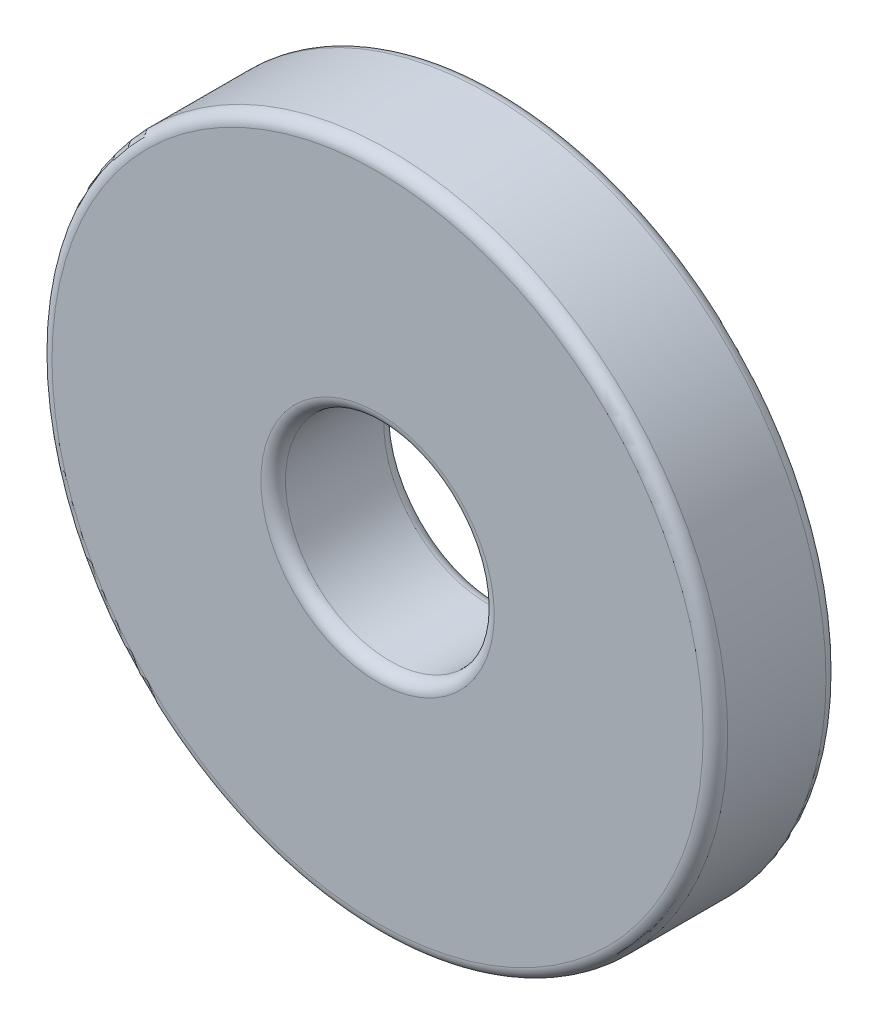
ISO-10303-21;
HEADER;
FILE_DESCRIPTION(('STEP AP214'),'2;1');
FILE_NAME('part.step','',(''),(''),'','','');
FILE_SCHEMA(('AUTOMOTIVE_DESIGN { 1 0 10303 214 1 1 1 1 }'));
ENDSEC;
DATA;
#1=APPLICATION_CONTEXT('core data for automotive mechanical design processes');
#2=APPLICATION_PROTOCOL_DEFINITION('international standard','automotive_design',2000,#1);
#3=PRODUCT_CONTEXT('',#1,'mechanical');
#4=PRODUCT('Part','Part','',(#3));
#5=PRODUCT_RELATED_PRODUCT_CATEGORY('part','',(#4));
#6=PRODUCT_DEFINITION_FORMATION('','',#4);
#7=PRODUCT_DEFINITION_CONTEXT('part definition',#1,'design');
#8=PRODUCT_DEFINITION('design','',#6,#7);
#9=PRODUCT_DEFINITION_SHAPE('','',#8);
#10=(LENGTH_UNIT() NAMED_UNIT(*) SI_UNIT(.MILLI.,.METRE.));
#11=(NAMED_UNIT(*) PLANE_ANGLE_UNIT() SI_UNIT($,.RADIAN.));
#12=(NAMED_UNIT(*) SI_UNIT($,.STERADIAN.) SOLID_ANGLE_UNIT());
#13=UNCERTAINTY_MEASURE_WITH_UNIT(LENGTH_MEASURE(1.E-05),#10,'distance_accuracy_value','');
#14=(GEOMETRIC_REPRESENTATION_CONTEXT(3) GLOBAL_UNCERTAINTY_ASSIGNED_CONTEXT((#13)) GLOBAL_UNIT_ASSIGNED_CONTEXT((#10,
#11,#12)) REPRESENTATION_CONTEXT('',''));
#15=CARTESIAN_POINT('',(0.,0.,0.));
#16=DIRECTION('',(0.,0.,1.));
#17=DIRECTION('',(1.,0.,0.));
#18=AXIS2_PLACEMENT_3D('',#15,#16,#17);
#19=CARTESIAN_POINT('',(0.,0.,10.));
#20=DIRECTION('',(0.,0.,1.));
#21=DIRECTION('',(1.,0.,0.));
#22=AXIS2_PLACEMENT_3D('',#19,#20,#21);
#23=PLANE('',#22);
#24=CARTESIAN_POINT('',(0.,0.,10.));
#25=DIRECTION('',(0.,0.,1.));
#26=DIRECTION('',(1.,0.,0.));
#27=AXIS2_PLACEMENT_3D('',#24,#25,#26);
#28=CIRCLE('',#27,9.5);
#29=CARTESIAN_POINT('',(9.5,0.,10.));
#30=VERTEX_POINT('',#29);
#31=EDGE_CURVE('E42',#30,#30,#28,.F.);
#32=ORIENTED_EDGE('',*,*,#31,.T.);
#33=EDGE_LOOP('',(#32));
#34=FACE_BOUND('',#33,.T.);
#35=CARTESIAN_POINT('',(0.,0.,10.));
#36=DIRECTION('',(0.,0.,1.));
#37=DIRECTION('',(1.,0.,0.));
#38=AXIS2_PLACEMENT_3D('',#35,#36,#37);
#39=CIRCLE('',#38,26.5);
#40=CARTESIAN_POINT('',(26.5,0.,10.));
#41=VERTEX_POINT('',#40);
#42=EDGE_CURVE('E46',#41,#41,#39,.T.);
#43=ORIENTED_EDGE('',*,*,#42,.T.);
#44=EDGE_LOOP('',(#43));
#45=FACE_BOUND('',#44,.T.);
#46=ADVANCED_FACE('F31',(#34,#45),#23,.T.);
#47=CARTESIAN_POINT('',(0.,0.,0.));
#48=DIRECTION('',(0.,0.,1.));
#49=DIRECTION('',(1.,0.,0.));
#50=AXIS2_PLACEMENT_3D('',#47,#48,#49);
#51=PLANE('',#50);
#52=CARTESIAN_POINT('',(0.,0.,0.));
#53=DIRECTION('',(0.,0.,1.));
#54=DIRECTION('',(1.,0.,0.));
#55=AXIS2_PLACEMENT_3D('',#52,#53,#54);
#56=CIRCLE('',#55,9.5);
#57=CARTESIAN_POINT('',(9.5,0.,0.));
#58=VERTEX_POINT('',#57);
#59=EDGE_CURVE('E57',#58,#58,#56,.T.);
#60=ORIENTED_EDGE('',*,*,#59,.T.);
#61=EDGE_LOOP('',(#60));
#62=FACE_BOUND('',#61,.T.);
#63=CARTESIAN_POINT('',(0.,0.,0.));
#64=DIRECTION('',(0.,0.,1.));
#65=DIRECTION('',(1.,0.,0.));
#66=AXIS2_PLACEMENT_3D('',#63,#64,#65);
#67=CIRCLE('',#66,26.5);
#68=CARTESIAN_POINT('',(26.5,0.,0.));
#69=VERTEX_POINT('',#68);
#70=EDGE_CURVE('E60',#69,#69,#67,.F.);
#71=ORIENTED_EDGE('',*,*,#70,.T.);
#72=EDGE_LOOP('',(#71));
#73=FACE_BOUND('',#72,.T.);
#74=ADVANCED_FACE('F64',(#62,#73),#51,.F.);
#75=CARTESIAN_POINT('',(0.,0.,10.));
#76=DIRECTION('',(0.,0.,-1.));
#77=DIRECTION('',(-1.,0.,0.));
#78=AXIS2_PLACEMENT_3D('',#75,#76,#77);
#79=CYLINDRICAL_SURFACE('',#78,27.5);
#80=CARTESIAN_POINT('',(0.,0.,0.999999999999999));
#81=DIRECTION('',(0.,0.,1.));
#82=DIRECTION('',(1.,0.,0.));
#83=AXIS2_PLACEMENT_3D('',#80,#81,#82);
#84=CIRCLE('',#83,27.5);
#85=CARTESIAN_POINT('',(27.5,0.,0.999999999999999));
#86=VERTEX_POINT('',#85);
#87=EDGE_CURVE('E10',#86,#86,#84,.T.);
#88=ORIENTED_EDGE('',*,*,#87,.T.);
#89=EDGE_LOOP('',(#88));
#90=FACE_BOUND('',#89,.T.);
#91=CARTESIAN_POINT('',(0.,0.,9.));
#92=DIRECTION('',(0.,0.,1.));
#93=DIRECTION('',(1.,0.,0.));
#94=AXIS2_PLACEMENT_3D('',#91,#92,#93);
#95=CIRCLE('',#94,27.5);
#96=CARTESIAN_POINT('',(27.5,0.,9.));
#97=VERTEX_POINT('',#96);
#98=EDGE_CURVE('E38',#97,#97,#95,.F.);
#99=ORIENTED_EDGE('',*,*,#98,.T.);
#100=EDGE_LOOP('',(#99));
#101=FACE_BOUND('',#100,.T.);
#102=ADVANCED_FACE('F84',(#90,#101),#79,.T.);
#103=CARTESIAN_POINT('',(0.,0.,10.));
#104=DIRECTION('',(0.,0.,-1.));
#105=DIRECTION('',(-1.,0.,0.));
#106=AXIS2_PLACEMENT_3D('',#103,#104,#105);
#107=CYLINDRICAL_SURFACE('',#106,8.5);
#108=CARTESIAN_POINT('',(0.,0.,0.999999999999999));
#109=DIRECTION('',(0.,0.,1.));
#110=DIRECTION('',(1.,0.,0.));
#111=AXIS2_PLACEMENT_3D('',#108,#109,#110);
#112=CIRCLE('',#111,8.5);
#113=CARTESIAN_POINT('',(8.5,0.,0.999999999999999));
#114=VERTEX_POINT('',#113);
#115=EDGE_CURVE('E51',#114,#114,#112,.F.);
#116=ORIENTED_EDGE('',*,*,#115,.T.);
#117=EDGE_LOOP('',(#116));
#118=FACE_BOUND('',#117,.T.);
#119=CARTESIAN_POINT('',(0.,0.,9.));
#120=DIRECTION('',(0.,0.,1.));
#121=DIRECTION('',(1.,0.,0.));
#122=AXIS2_PLACEMENT_3D('',#119,#120,#121);
#123=CIRCLE('',#122,8.5);
#124=CARTESIAN_POINT('',(8.5,0.,9.));
#125=VERTEX_POINT('',#124);
#126=EDGE_CURVE('E54',#125,#125,#123,.T.);
#127=ORIENTED_EDGE('',*,*,#126,.T.);
#128=EDGE_LOOP('',(#127));
#129=FACE_BOUND('',#128,.T.);
#130=ADVANCED_FACE('F89',(#118,#129),#107,.F.);
#131=CARTESIAN_POINT('',(0.,0.,0.999999999999999));
#132=DIRECTION('',(0.,0.,1.));
#133=DIRECTION('',(1.,0.,0.));
#134=AXIS2_PLACEMENT_3D('',#131,#132,#133);
#135=TOROIDAL_SURFACE('',#134,9.5,1.);
#136=ORIENTED_EDGE('',*,*,#115,.F.);
#137=EDGE_LOOP('',(#136));
#138=FACE_BOUND('',#137,.T.);
#139=ORIENTED_EDGE('',*,*,#59,.F.);
#140=EDGE_LOOP('',(#139));
#141=FACE_BOUND('',#140,.T.);
#142=ADVANCED_FACE('F75',(#138,#141),#135,.T.);
#143=CARTESIAN_POINT('',(0.,0.,9.));
#144=DIRECTION('',(0.,0.,1.));
#145=DIRECTION('',(1.,0.,0.));
#146=AXIS2_PLACEMENT_3D('',#143,#144,#145);
#147=TOROIDAL_SURFACE('',#146,9.5,1.);
#148=ORIENTED_EDGE('',*,*,#31,.F.);
#149=EDGE_LOOP('',(#148));
#150=FACE_BOUND('',#149,.T.);
#151=ORIENTED_EDGE('',*,*,#126,.F.);
#152=EDGE_LOOP('',(#151));
#153=FACE_BOUND('',#152,.T.);
#154=ADVANCED_FACE('F69',(#150,#153),#147,.T.);
#155=CARTESIAN_POINT('',(0.,0.,0.999999999999999));
#156=DIRECTION('',(0.,0.,1.));
#157=DIRECTION('',(1.,0.,0.));
#158=AXIS2_PLACEMENT_3D('',#155,#156,#157);
#159=TOROIDAL_SURFACE('',#158,26.5,1.);
#160=ORIENTED_EDGE('',*,*,#70,.F.);
#161=EDGE_LOOP('',(#160));
#162=FACE_BOUND('',#161,.T.);
#163=ORIENTED_EDGE('',*,*,#87,.F.);
#164=EDGE_LOOP('',(#163));
#165=FACE_BOUND('',#164,.T.);
#166=ADVANCED_FACE('F66',(#162,#165),#159,.T.);
#167=CARTESIAN_POINT('',(0.,0.,9.));
#168=DIRECTION('',(0.,0.,1.));
#169=DIRECTION('',(1.,0.,0.));
#170=AXIS2_PLACEMENT_3D('',#167,#168,#169);
#171=TOROIDAL_SURFACE('',#170,26.5,1.);
#172=ORIENTED_EDGE('',*,*,#98,.F.);
#173=EDGE_LOOP('',(#172));
#174=FACE_BOUND('',#173,.T.);
#175=ORIENTED_EDGE('',*,*,#42,.F.);
#176=EDGE_LOOP('',(#175));
#177=FACE_BOUND('',#176,.T.);
#178=ADVANCED_FACE('F33',(#174,#177),#171,.T.);
#179=CLOSED_SHELL('',(#46,#74,#102,#130,#142,#154,#166,#178));
#180=MANIFOLD_SOLID_BREP('B2',#179);
#181=ADVANCED_BREP_SHAPE_REPRESENTATION('',(#18,#180),#14);
#182=SHAPE_DEFINITION_REPRESENTATION(#9,#181);
ENDSEC;
END-ISO-10303-21;
